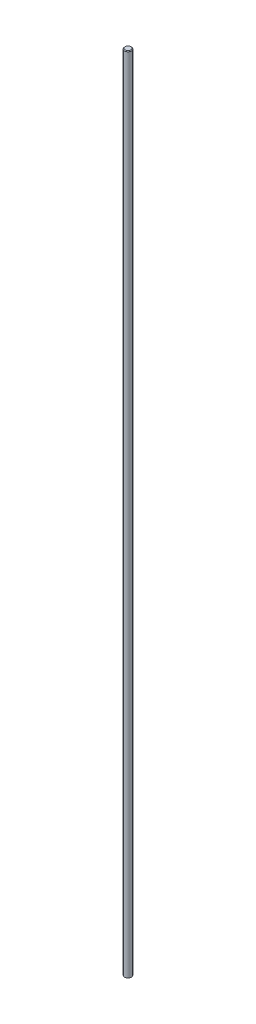
ISO-10303-21;
HEADER;
FILE_DESCRIPTION(('STEP AP214'),'2;1');
FILE_NAME('part.step','',(''),(''),'','','');
FILE_SCHEMA(('AUTOMOTIVE_DESIGN { 1 0 10303 214 1 1 1 1 }'));
ENDSEC;
DATA;
#1=APPLICATION_CONTEXT('core data for automotive mechanical design processes');
#2=APPLICATION_PROTOCOL_DEFINITION('international standard','automotive_design',2000,#1);
#3=PRODUCT_CONTEXT('',#1,'mechanical');
#4=PRODUCT('Part','Part','',(#3));
#5=PRODUCT_RELATED_PRODUCT_CATEGORY('part','',(#4));
#6=PRODUCT_DEFINITION_FORMATION('','',#4);
#7=PRODUCT_DEFINITION_CONTEXT('part definition',#1,'design');
#8=PRODUCT_DEFINITION('design','',#6,#7);
#9=PRODUCT_DEFINITION_SHAPE('','',#8);
#10=(LENGTH_UNIT() NAMED_UNIT(*) SI_UNIT(.MILLI.,.METRE.));
#11=(NAMED_UNIT(*) PLANE_ANGLE_UNIT() SI_UNIT($,.RADIAN.));
#12=(NAMED_UNIT(*) SI_UNIT($,.STERADIAN.) SOLID_ANGLE_UNIT());
#13=UNCERTAINTY_MEASURE_WITH_UNIT(LENGTH_MEASURE(1.E-05),#10,'distance_accuracy_value','');
#14=(GEOMETRIC_REPRESENTATION_CONTEXT(3) GLOBAL_UNCERTAINTY_ASSIGNED_CONTEXT((#13)) GLOBAL_UNIT_ASSIGNED_CONTEXT((#10,
#11,#12)) REPRESENTATION_CONTEXT('',''));
#15=CARTESIAN_POINT('',(0.,0.,0.));
#16=DIRECTION('',(0.,0.,1.));
#17=DIRECTION('',(1.,0.,0.));
#18=AXIS2_PLACEMENT_3D('',#15,#16,#17);
#19=CARTESIAN_POINT('',(0.,0.,0.));
#20=DIRECTION('',(0.,1.,0.));
#21=DIRECTION('',(0.,0.,1.));
#22=AXIS2_PLACEMENT_3D('',#19,#20,#21);
#23=PLANE('',#22);
#24=CARTESIAN_POINT('',(0.,0.,0.));
#25=DIRECTION('',(0.,-1.,0.));
#26=DIRECTION('',(0.,0.,-1.));
#27=AXIS2_PLACEMENT_3D('',#24,#25,#26);
#28=CIRCLE('',#27,1.5);
#29=CARTESIAN_POINT('',(0.,0.,-1.5));
#30=VERTEX_POINT('',#29);
#31=EDGE_CURVE('E10',#30,#30,#28,.T.);
#32=ORIENTED_EDGE('',*,*,#31,.T.);
#33=EDGE_LOOP('',(#32));
#34=FACE_BOUND('',#33,.T.);
#35=ADVANCED_FACE('F46',(#34),#23,.F.);
#36=CARTESIAN_POINT('',(0.,352.25,0.));
#37=DIRECTION('',(0.,-1.,0.));
#38=DIRECTION('',(0.,0.,-1.));
#39=AXIS2_PLACEMENT_3D('',#36,#37,#38);
#40=CYLINDRICAL_SURFACE('',#39,1.5);
#41=ORIENTED_EDGE('',*,*,#31,.F.);
#42=EDGE_LOOP('',(#41));
#43=FACE_BOUND('',#42,.T.);
#44=CARTESIAN_POINT('',(0.,351.9695,0.));
#45=DIRECTION('',(0.,-1.,0.));
#46=DIRECTION('',(0.,0.,-1.));
#47=AXIS2_PLACEMENT_3D('',#44,#45,#46);
#48=CIRCLE('',#47,1.5);
#49=CARTESIAN_POINT('',(0.,351.9695,-1.5));
#50=VERTEX_POINT('',#49);
#51=EDGE_CURVE('E58',#50,#50,#48,.T.);
#52=ORIENTED_EDGE('',*,*,#51,.T.);
#53=EDGE_LOOP('',(#52));
#54=FACE_BOUND('',#53,.T.);
#55=ADVANCED_FACE('F66',(#43,#54),#40,.T.);
#56=CARTESIAN_POINT('',(0.,352.25,0.));
#57=DIRECTION('',(0.,-1.,0.));
#58=DIRECTION('',(0.,0.,-1.));
#59=AXIS2_PLACEMENT_3D('',#56,#57,#58);
#60=CONICAL_SURFACE('',#59,1.2195,0.785398163397416);
#61=ORIENTED_EDGE('',*,*,#51,.F.);
#62=EDGE_LOOP('',(#61));
#63=FACE_BOUND('',#62,.T.);
#64=CARTESIAN_POINT('',(0.,352.25,0.));
#65=DIRECTION('',(0.,-1.,0.));
#66=DIRECTION('',(0.,0.,-1.));
#67=AXIS2_PLACEMENT_3D('',#64,#65,#66);
#68=CIRCLE('',#67,1.2195);
#69=CARTESIAN_POINT('',(0.,352.25,-1.2195));
#70=VERTEX_POINT('',#69);
#71=EDGE_CURVE('E53',#70,#70,#68,.T.);
#72=ORIENTED_EDGE('',*,*,#71,.T.);
#73=EDGE_LOOP('',(#72));
#74=FACE_BOUND('',#73,.T.);
#75=ADVANCED_FACE('F68',(#63,#74),#60,.T.);
#76=CARTESIAN_POINT('',(0.,352.25,0.));
#77=DIRECTION('',(0.,1.,0.));
#78=DIRECTION('',(0.,0.,1.));
#79=AXIS2_PLACEMENT_3D('',#76,#77,#78);
#80=PLANE('',#79);
#81=ORIENTED_EDGE('',*,*,#71,.F.);
#82=EDGE_LOOP('',(#81));
#83=FACE_BOUND('',#82,.T.);
#84=ADVANCED_FACE('F70',(#83),#80,.T.);
#85=CLOSED_SHELL('',(#35,#55,#75,#84));
#86=MANIFOLD_SOLID_BREP('B2',#85);
#87=ADVANCED_BREP_SHAPE_REPRESENTATION('',(#18,#86),#14);
#88=SHAPE_DEFINITION_REPRESENTATION(#9,#87);
ENDSEC;
END-ISO-10303-21;
